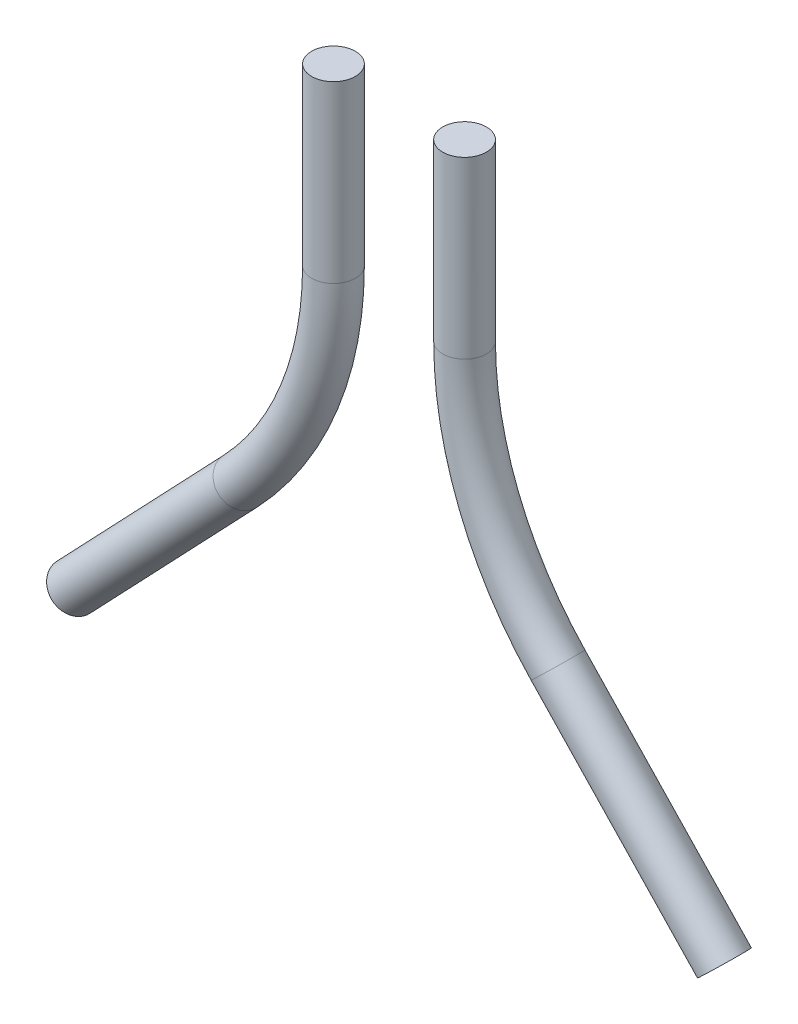
ISO-10303-21;
HEADER;
FILE_DESCRIPTION(('STEP AP214'),'2;1');
FILE_NAME('part.step','',(''),(''),'','','');
FILE_SCHEMA(('AUTOMOTIVE_DESIGN { 1 0 10303 214 1 1 1 1 }'));
ENDSEC;
DATA;
#1=APPLICATION_CONTEXT('core data for automotive mechanical design processes');
#2=APPLICATION_PROTOCOL_DEFINITION('international standard','automotive_design',2000,#1);
#3=PRODUCT_CONTEXT('',#1,'mechanical');
#4=PRODUCT('Part','Part','',(#3));
#5=PRODUCT_RELATED_PRODUCT_CATEGORY('part','',(#4));
#6=PRODUCT_DEFINITION_FORMATION('','',#4);
#7=PRODUCT_DEFINITION_CONTEXT('part definition',#1,'design');
#8=PRODUCT_DEFINITION('design','',#6,#7);
#9=PRODUCT_DEFINITION_SHAPE('','',#8);
#10=(LENGTH_UNIT() NAMED_UNIT(*) SI_UNIT(.MILLI.,.METRE.));
#11=(NAMED_UNIT(*) PLANE_ANGLE_UNIT() SI_UNIT($,.RADIAN.));
#12=(NAMED_UNIT(*) SI_UNIT($,.STERADIAN.) SOLID_ANGLE_UNIT());
#13=UNCERTAINTY_MEASURE_WITH_UNIT(LENGTH_MEASURE(1.E-05),#10,'distance_accuracy_value','');
#14=(GEOMETRIC_REPRESENTATION_CONTEXT(3) GLOBAL_UNCERTAINTY_ASSIGNED_CONTEXT((#13)) GLOBAL_UNIT_ASSIGNED_CONTEXT((#10,
#11,#12)) REPRESENTATION_CONTEXT('',''));
#15=CARTESIAN_POINT('',(0.,0.,0.));
#16=DIRECTION('',(0.,0.,1.));
#17=DIRECTION('',(1.,0.,0.));
#18=AXIS2_PLACEMENT_3D('',#15,#16,#17);
#19=CARTESIAN_POINT('',(-1.81896551724135,-4.67241379310345,0.));
#20=DIRECTION('',(-0.689655172413785,-0.724137931034491,0.));
#21=DIRECTION('',(-0.724137931034491,0.689655172413785,0.));
#22=AXIS2_PLACEMENT_3D('',#19,#20,#21);
#23=CYLINDRICAL_SURFACE('',#22,0.25);
#24=CARTESIAN_POINT('',(-1.81896551724135,-4.67241379310345,0.));
#25=DIRECTION('',(-0.689655172413784,-0.724137931034492,0.));
#26=DIRECTION('',(0.,0.,1.));
#27=AXIS2_PLACEMENT_3D('',#24,#25,#26);
#28=CIRCLE('',#27,0.25);
#29=CARTESIAN_POINT('',(-1.63793103448273,-4.8448275862069,0.));
#30=VERTEX_POINT('',#29);
#31=EDGE_CURVE('E44',#30,#30,#28,.T.);
#32=ORIENTED_EDGE('',*,*,#31,.T.);
#33=EDGE_LOOP('',(#32));
#34=FACE_BOUND('',#33,.T.);
#35=CARTESIAN_POINT('',(-3.72372742200321,-6.67241379310345,0.));
#36=DIRECTION('',(-0.689655172413784,-0.724137931034492,0.));
#37=DIRECTION('',(0.,0.,1.));
#38=AXIS2_PLACEMENT_3D('',#35,#36,#37);
#39=CIRCLE('',#38,0.25);
#40=CARTESIAN_POINT('',(-3.72372742200321,-6.67241379310345,0.25));
#41=VERTEX_POINT('',#40);
#42=EDGE_CURVE('E11',#41,#41,#39,.T.);
#43=ORIENTED_EDGE('',*,*,#42,.F.);
#44=EDGE_LOOP('',(#43));
#45=FACE_BOUND('',#44,.T.);
#46=ADVANCED_FACE('F38',(#34,#45),#23,.T.);
#47=CARTESIAN_POINT('',(-4.62500000000005,-2.,0.));
#48=DIRECTION('',(0.,0.,1.));
#49=DIRECTION('',(-1.,0.,0.));
#50=AXIS2_PLACEMENT_3D('',#47,#48,#49);
#51=TOROIDAL_SURFACE('',#50,3.87500000000006,0.25);
#52=CARTESIAN_POINT('',(-0.749999999999993,-2.,0.));
#53=DIRECTION('',(0.,-1.,0.));
#54=DIRECTION('',(0.,0.,1.));
#55=AXIS2_PLACEMENT_3D('',#52,#53,#54);
#56=CIRCLE('',#55,0.25);
#57=CARTESIAN_POINT('',(-0.499999999999993,-2.,0.));
#58=VERTEX_POINT('',#57);
#59=EDGE_CURVE('E48',#58,#58,#56,.T.);
#60=CARTESIAN_POINT('',(-4.62500000000005,-2.,0.));
#61=DIRECTION('',(0.,0.,1.));
#62=DIRECTION('',(-1.,0.,0.));
#63=AXIS2_PLACEMENT_3D('',#60,#61,#62);
#64=CIRCLE('',#63,4.12500000000006);
#65=EDGE_CURVE('',#30,#58,#64,.T.);
#66=ORIENTED_EDGE('',*,*,#31,.F.);
#67=ORIENTED_EDGE('',*,*,#59,.T.);
#68=ORIENTED_EDGE('',*,*,#65,.T.);
#69=ORIENTED_EDGE('',*,*,#65,.F.);
#70=EDGE_LOOP('',(#66,#68,#67,#69));
#71=FACE_BOUND('',#70,.T.);
#72=ADVANCED_FACE('F70',(#71),#51,.T.);
#73=CARTESIAN_POINT('',(-0.749999999999993,-2.,0.));
#74=DIRECTION('',(0.,1.,0.));
#75=DIRECTION('',(1.,0.,0.));
#76=AXIS2_PLACEMENT_3D('',#73,#74,#75);
#77=CYLINDRICAL_SURFACE('',#76,0.25);
#78=ORIENTED_EDGE('',*,*,#59,.F.);
#79=EDGE_LOOP('',(#78));
#80=FACE_BOUND('',#79,.T.);
#81=CARTESIAN_POINT('',(-0.749999999999987,0.,0.));
#82=DIRECTION('',(0.,-1.,0.));
#83=DIRECTION('',(0.,0.,1.));
#84=AXIS2_PLACEMENT_3D('',#81,#82,#83);
#85=CIRCLE('',#84,0.25);
#86=CARTESIAN_POINT('',(-0.749999999999987,0.,0.25));
#87=VERTEX_POINT('',#86);
#88=EDGE_CURVE('E52',#87,#87,#85,.T.);
#89=ORIENTED_EDGE('',*,*,#88,.T.);
#90=EDGE_LOOP('',(#89));
#91=FACE_BOUND('',#90,.T.);
#92=ADVANCED_FACE('F58',(#80,#91),#77,.T.);
#93=CARTESIAN_POINT('',(-3.72372742200321,-6.67241379310345,0.));
#94=DIRECTION('',(0.689655172413784,0.724137931034492,0.));
#95=DIRECTION('',(0.,0.,1.));
#96=AXIS2_PLACEMENT_3D('',#93,#94,#95);
#97=PLANE('',#96);
#98=ORIENTED_EDGE('',*,*,#42,.T.);
#99=EDGE_LOOP('',(#98));
#100=FACE_BOUND('',#99,.T.);
#101=ADVANCED_FACE('F62',(#100),#97,.F.);
#102=CARTESIAN_POINT('',(-0.749999999999987,0.,0.));
#103=DIRECTION('',(0.,1.,0.));
#104=DIRECTION('',(0.,0.,1.));
#105=AXIS2_PLACEMENT_3D('',#102,#103,#104);
#106=PLANE('',#105);
#107=ORIENTED_EDGE('',*,*,#88,.F.);
#108=EDGE_LOOP('',(#107));
#109=FACE_BOUND('',#108,.T.);
#110=ADVANCED_FACE('F60',(#109),#106,.T.);
#111=CLOSED_SHELL('',(#46,#72,#92,#101,#110));
#112=MANIFOLD_SOLID_BREP('B2',#111);
#113=CARTESIAN_POINT('',(1.81896551724135,-4.67241379310345,0.));
#114=DIRECTION('',(0.689655172413785,-0.724137931034491,0.));
#115=DIRECTION('',(0.724137931034491,0.689655172413785,0.));
#116=AXIS2_PLACEMENT_3D('',#113,#114,#115);
#117=CYLINDRICAL_SURFACE('',#116,0.25);
#118=CARTESIAN_POINT('',(1.81896551724135,-4.67241379310345,0.));
#119=DIRECTION('',(-0.689655172413784,0.724137931034492,0.));
#120=DIRECTION('',(0.,0.,1.));
#121=AXIS2_PLACEMENT_3D('',#118,#119,#120);
#122=CIRCLE('',#121,0.25);
#123=CARTESIAN_POINT('',(1.63793103448273,-4.8448275862069,0.));
#124=VERTEX_POINT('',#123);
#125=EDGE_CURVE('E114',#124,#124,#122,.T.);
#126=ORIENTED_EDGE('',*,*,#125,.F.);
#127=EDGE_LOOP('',(#126));
#128=FACE_BOUND('',#127,.T.);
#129=CARTESIAN_POINT('',(3.72372742200321,-6.67241379310345,0.));
#130=DIRECTION('',(-0.689655172413784,0.724137931034492,0.));
#131=DIRECTION('',(0.,0.,1.));
#132=AXIS2_PLACEMENT_3D('',#129,#130,#131);
#133=CIRCLE('',#132,0.25);
#134=CARTESIAN_POINT('',(3.72372742200321,-6.67241379310345,0.25));
#135=VERTEX_POINT('',#134);
#136=EDGE_CURVE('E37',#135,#135,#133,.T.);
#137=ORIENTED_EDGE('',*,*,#136,.T.);
#138=EDGE_LOOP('',(#137));
#139=FACE_BOUND('',#138,.T.);
#140=ADVANCED_FACE('F108',(#128,#139),#117,.T.);
#141=CARTESIAN_POINT('',(4.62500000000005,-2.,0.));
#142=DIRECTION('',(0.,0.,1.));
#143=DIRECTION('',(1.,0.,0.));
#144=AXIS2_PLACEMENT_3D('',#141,#142,#143);
#145=TOROIDAL_SURFACE('',#144,3.87500000000006,0.25);
#146=CARTESIAN_POINT('',(0.749999999999993,-2.,0.));
#147=DIRECTION('',(0.,1.,0.));
#148=DIRECTION('',(0.,0.,1.));
#149=AXIS2_PLACEMENT_3D('',#146,#147,#148);
#150=CIRCLE('',#149,0.25);
#151=CARTESIAN_POINT('',(0.499999999999993,-2.,0.));
#152=VERTEX_POINT('',#151);
#153=EDGE_CURVE('E118',#152,#152,#150,.T.);
#154=CARTESIAN_POINT('',(4.62500000000005,-2.,0.));
#155=DIRECTION('',(0.,0.,1.));
#156=DIRECTION('',(1.,0.,0.));
#157=AXIS2_PLACEMENT_3D('',#154,#155,#156);
#158=CIRCLE('',#157,4.12500000000006);
#159=EDGE_CURVE('',#152,#124,#158,.T.);
#160=ORIENTED_EDGE('',*,*,#153,.F.);
#161=ORIENTED_EDGE('',*,*,#125,.T.);
#162=ORIENTED_EDGE('',*,*,#159,.T.);
#163=ORIENTED_EDGE('',*,*,#159,.F.);
#164=EDGE_LOOP('',(#160,#162,#161,#163));
#165=FACE_BOUND('',#164,.T.);
#166=ADVANCED_FACE('F133',(#165),#145,.T.);
#167=CARTESIAN_POINT('',(0.749999999999993,-2.,0.));
#168=DIRECTION('',(0.,1.,0.));
#169=DIRECTION('',(-1.,0.,0.));
#170=AXIS2_PLACEMENT_3D('',#167,#168,#169);
#171=CYLINDRICAL_SURFACE('',#170,0.25);
#172=ORIENTED_EDGE('',*,*,#153,.T.);
#173=EDGE_LOOP('',(#172));
#174=FACE_BOUND('',#173,.T.);
#175=CARTESIAN_POINT('',(0.749999999999987,0.,0.));
#176=DIRECTION('',(0.,1.,0.));
#177=DIRECTION('',(0.,0.,1.));
#178=AXIS2_PLACEMENT_3D('',#175,#176,#177);
#179=CIRCLE('',#178,0.25);
#180=CARTESIAN_POINT('',(0.749999999999987,0.,0.25));
#181=VERTEX_POINT('',#180);
#182=EDGE_CURVE('E122',#181,#181,#179,.T.);
#183=ORIENTED_EDGE('',*,*,#182,.F.);
#184=EDGE_LOOP('',(#183));
#185=FACE_BOUND('',#184,.T.);
#186=ADVANCED_FACE('F130',(#174,#185),#171,.T.);
#187=CARTESIAN_POINT('',(3.72372742200321,-6.67241379310345,0.));
#188=DIRECTION('',(-0.689655172413784,0.724137931034492,0.));
#189=DIRECTION('',(0.,0.,1.));
#190=AXIS2_PLACEMENT_3D('',#187,#188,#189);
#191=PLANE('',#190);
#192=ORIENTED_EDGE('',*,*,#136,.F.);
#193=EDGE_LOOP('',(#192));
#194=FACE_BOUND('',#193,.T.);
#195=ADVANCED_FACE('F132',(#194),#191,.F.);
#196=CARTESIAN_POINT('',(0.749999999999987,0.,0.));
#197=DIRECTION('',(0.,1.,0.));
#198=DIRECTION('',(0.,0.,1.));
#199=AXIS2_PLACEMENT_3D('',#196,#197,#198);
#200=PLANE('',#199);
#201=ORIENTED_EDGE('',*,*,#182,.T.);
#202=EDGE_LOOP('',(#201));
#203=FACE_BOUND('',#202,.T.);
#204=ADVANCED_FACE('F128',(#203),#200,.T.);
#205=CLOSED_SHELL('',(#140,#166,#186,#195,#204));
#206=MANIFOLD_SOLID_BREP('B6',#205);
#207=ADVANCED_BREP_SHAPE_REPRESENTATION('',(#18,#112,#206),#14);
#208=SHAPE_DEFINITION_REPRESENTATION(#9,#207);
ENDSEC;
END-ISO-10303-21;
